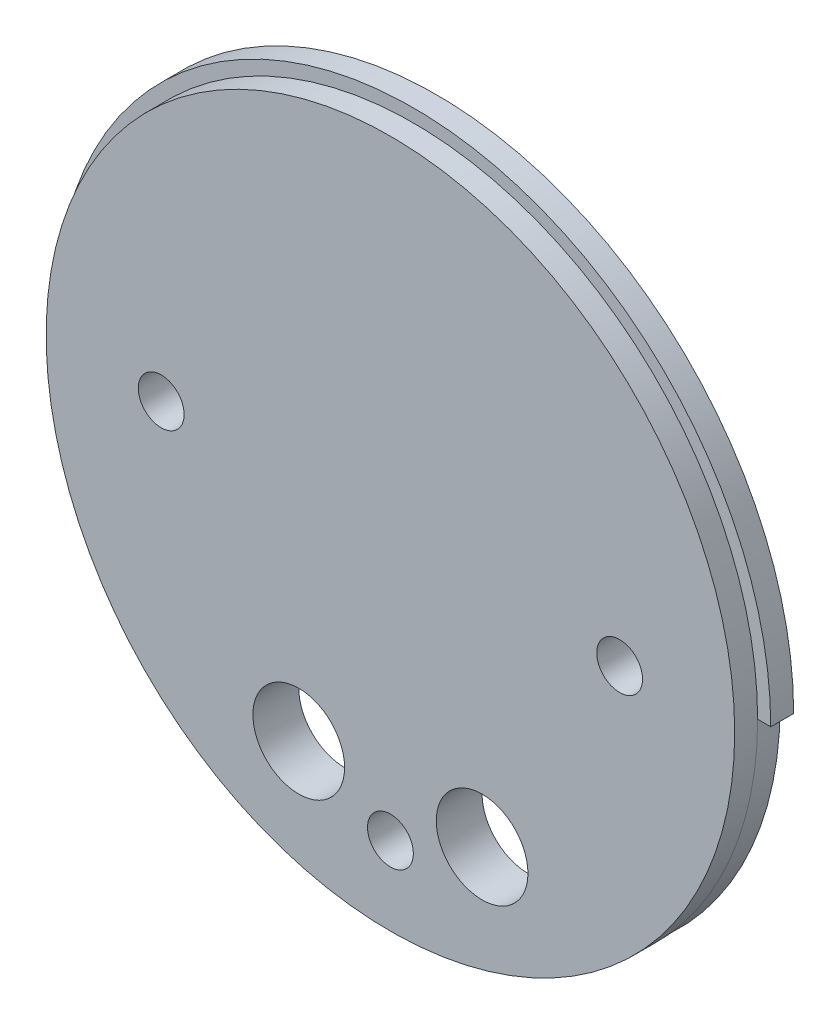
ISO-10303-21;
HEADER;
FILE_DESCRIPTION(('STEP AP214'),'2;1');
FILE_NAME('part.step','',(''),(''),'','','');
FILE_SCHEMA(('AUTOMOTIVE_DESIGN { 1 0 10303 214 1 1 1 1 }'));
ENDSEC;
DATA;
#1=APPLICATION_CONTEXT('core data for automotive mechanical design processes');
#2=APPLICATION_PROTOCOL_DEFINITION('international standard','automotive_design',2000,#1);
#3=PRODUCT_CONTEXT('',#1,'mechanical');
#4=PRODUCT('Part','Part','',(#3));
#5=PRODUCT_RELATED_PRODUCT_CATEGORY('part','',(#4));
#6=PRODUCT_DEFINITION_FORMATION('','',#4);
#7=PRODUCT_DEFINITION_CONTEXT('part definition',#1,'design');
#8=PRODUCT_DEFINITION('design','',#6,#7);
#9=PRODUCT_DEFINITION_SHAPE('','',#8);
#10=(LENGTH_UNIT() NAMED_UNIT(*) SI_UNIT(.MILLI.,.METRE.));
#11=(NAMED_UNIT(*) PLANE_ANGLE_UNIT() SI_UNIT($,.RADIAN.));
#12=(NAMED_UNIT(*) SI_UNIT($,.STERADIAN.) SOLID_ANGLE_UNIT());
#13=UNCERTAINTY_MEASURE_WITH_UNIT(LENGTH_MEASURE(1.E-05),#10,'distance_accuracy_value','');
#14=(GEOMETRIC_REPRESENTATION_CONTEXT(3) GLOBAL_UNCERTAINTY_ASSIGNED_CONTEXT((#13)) GLOBAL_UNIT_ASSIGNED_CONTEXT((#10,
#11,#12)) REPRESENTATION_CONTEXT('',''));
#15=CARTESIAN_POINT('',(0.,0.,0.));
#16=DIRECTION('',(0.,0.,1.));
#17=DIRECTION('',(1.,0.,0.));
#18=AXIS2_PLACEMENT_3D('',#15,#16,#17);
#19=CARTESIAN_POINT('',(0.,0.,3.175));
#20=DIRECTION('',(0.,0.,-1.));
#21=DIRECTION('',(-1.,0.,0.));
#22=AXIS2_PLACEMENT_3D('',#19,#20,#21);
#23=CYLINDRICAL_SURFACE('',#22,49.5046);
#24=CARTESIAN_POINT('',(0.,0.,3.175));
#25=DIRECTION('',(0.,0.,1.));
#26=DIRECTION('',(1.,0.,0.));
#27=AXIS2_PLACEMENT_3D('',#24,#25,#26);
#28=CIRCLE('',#27,49.5046);
#29=CARTESIAN_POINT('',(49.5046,0.,3.175));
#30=VERTEX_POINT('',#29);
#31=CARTESIAN_POINT('',(-49.5046,0.,3.175));
#32=VERTEX_POINT('',#31);
#33=EDGE_CURVE('E149',#30,#32,#28,.T.);
#34=ORIENTED_EDGE('',*,*,#33,.F.);
#35=DIRECTION('',(0.,0.,-1.));
#36=VECTOR('',#35,1.);
#37=CARTESIAN_POINT('',(49.5046,0.,3.175));
#38=LINE('',#37,#36);
#39=CARTESIAN_POINT('',(49.5046,0.,0.));
#40=VERTEX_POINT('',#39);
#41=EDGE_CURVE('E110',#30,#40,#38,.T.);
#42=ORIENTED_EDGE('',*,*,#41,.T.);
#43=CARTESIAN_POINT('',(0.,0.,0.));
#44=DIRECTION('',(0.,0.,1.));
#45=DIRECTION('',(1.,0.,0.));
#46=AXIS2_PLACEMENT_3D('',#43,#44,#45);
#47=CIRCLE('',#46,49.5046);
#48=CARTESIAN_POINT('',(-49.5046,0.,0.));
#49=VERTEX_POINT('',#48);
#50=EDGE_CURVE('E145',#40,#49,#47,.T.);
#51=ORIENTED_EDGE('',*,*,#50,.T.);
#52=DIRECTION('',(0.,0.,-1.));
#53=VECTOR('',#52,1.);
#54=CARTESIAN_POINT('',(-49.5046,0.,3.175));
#55=LINE('',#54,#53);
#56=EDGE_CURVE('E94',#49,#32,#55,.F.);
#57=ORIENTED_EDGE('',*,*,#56,.T.);
#58=EDGE_LOOP('',(#34,#42,#51,#57));
#59=FACE_BOUND('',#58,.T.);
#60=ADVANCED_FACE('F34',(#59),#23,.T.);
#61=CARTESIAN_POINT('',(0.,0.,3.175));
#62=DIRECTION('',(0.,0.,1.));
#63=DIRECTION('',(1.,0.,0.));
#64=AXIS2_PLACEMENT_3D('',#61,#62,#63);
#65=PLANE('',#64);
#66=DIRECTION('',(-1.,0.,0.));
#67=VECTOR('',#66,1.);
#68=CARTESIAN_POINT('',(47.625,0.,3.175));
#69=LINE('',#68,#67);
#70=CARTESIAN_POINT('',(47.6885,0.,3.175));
#71=VERTEX_POINT('',#70);
#72=EDGE_CURVE('E48',#30,#71,#69,.T.);
#73=ORIENTED_EDGE('',*,*,#72,.F.);
#74=ORIENTED_EDGE('',*,*,#33,.T.);
#75=DIRECTION('',(-1.,0.,0.));
#76=VECTOR('',#75,1.);
#77=CARTESIAN_POINT('',(-50.165,0.,3.175));
#78=LINE('',#77,#76);
#79=CARTESIAN_POINT('',(-47.6885,0.,3.175));
#80=VERTEX_POINT('',#79);
#81=EDGE_CURVE('E105',#80,#32,#78,.T.);
#82=ORIENTED_EDGE('',*,*,#81,.F.);
#83=CARTESIAN_POINT('',(0.,0.,3.175));
#84=DIRECTION('',(0.,0.,1.));
#85=DIRECTION('',(1.,0.,0.));
#86=AXIS2_PLACEMENT_3D('',#83,#84,#85);
#87=CIRCLE('',#86,47.6885);
#88=EDGE_CURVE('E41',#71,#80,#87,.T.);
#89=ORIENTED_EDGE('',*,*,#88,.F.);
#90=EDGE_LOOP('',(#73,#74,#82,#89));
#91=FACE_BOUND('',#90,.T.);
#92=ADVANCED_FACE('F156',(#91),#65,.T.);
#93=CARTESIAN_POINT('',(0.,0.,0.));
#94=DIRECTION('',(0.,0.,1.));
#95=DIRECTION('',(1.,0.,0.));
#96=AXIS2_PLACEMENT_3D('',#93,#94,#95);
#97=PLANE('',#96);
#98=CARTESIAN_POINT('',(-31.75,0.,0.));
#99=DIRECTION('',(0.,0.,1.));
#100=DIRECTION('',(1.,0.,0.));
#101=AXIS2_PLACEMENT_3D('',#98,#99,#100);
#102=CIRCLE('',#101,3.17500000000001);
#103=CARTESIAN_POINT('',(-28.575,0.,0.));
#104=VERTEX_POINT('',#103);
#105=EDGE_CURVE('E113',#104,#104,#102,.T.);
#106=ORIENTED_EDGE('',*,*,#105,.T.);
#107=EDGE_LOOP('',(#106));
#108=FACE_BOUND('',#107,.T.);
#109=CARTESIAN_POINT('',(0.,-36.8046,0.));
#110=DIRECTION('',(0.,0.,1.));
#111=DIRECTION('',(1.,0.,0.));
#112=AXIS2_PLACEMENT_3D('',#109,#110,#111);
#113=CIRCLE('',#112,3.175);
#114=CARTESIAN_POINT('',(3.175,-36.8046,0.));
#115=VERTEX_POINT('',#114);
#116=EDGE_CURVE('E128',#115,#115,#113,.T.);
#117=ORIENTED_EDGE('',*,*,#116,.T.);
#118=EDGE_LOOP('',(#117));
#119=FACE_BOUND('',#118,.T.);
#120=CARTESIAN_POINT('',(12.7,-31.2353524431853,0.));
#121=DIRECTION('',(0.,0.,1.));
#122=DIRECTION('',(1.,0.,0.));
#123=AXIS2_PLACEMENT_3D('',#120,#121,#122);
#124=CIRCLE('',#123,6.35);
#125=CARTESIAN_POINT('',(19.05,-31.2353524431853,0.));
#126=VERTEX_POINT('',#125);
#127=EDGE_CURVE('E121',#126,#126,#124,.T.);
#128=ORIENTED_EDGE('',*,*,#127,.T.);
#129=EDGE_LOOP('',(#128));
#130=FACE_BOUND('',#129,.T.);
#131=CARTESIAN_POINT('',(-12.7,-31.2353524431853,0.));
#132=DIRECTION('',(0.,0.,1.));
#133=DIRECTION('',(1.,0.,0.));
#134=AXIS2_PLACEMENT_3D('',#131,#132,#133);
#135=CIRCLE('',#134,6.35);
#136=CARTESIAN_POINT('',(-6.35,-31.2353524431853,0.));
#137=VERTEX_POINT('',#136);
#138=EDGE_CURVE('E138',#137,#137,#135,.T.);
#139=ORIENTED_EDGE('',*,*,#138,.T.);
#140=EDGE_LOOP('',(#139));
#141=FACE_BOUND('',#140,.T.);
#142=CARTESIAN_POINT('',(31.75,0.,0.));
#143=DIRECTION('',(0.,0.,1.));
#144=DIRECTION('',(1.,0.,0.));
#145=AXIS2_PLACEMENT_3D('',#142,#143,#144);
#146=CIRCLE('',#145,3.17500000000001);
#147=CARTESIAN_POINT('',(34.925,0.,0.));
#148=VERTEX_POINT('',#147);
#149=EDGE_CURVE('E120',#148,#148,#146,.T.);
#150=ORIENTED_EDGE('',*,*,#149,.T.);
#151=EDGE_LOOP('',(#150));
#152=FACE_BOUND('',#151,.T.);
#153=ORIENTED_EDGE('',*,*,#50,.F.);
#154=DIRECTION('',(-1.,0.,0.));
#155=VECTOR('',#154,1.);
#156=CARTESIAN_POINT('',(0.,0.,0.));
#157=LINE('',#156,#155);
#158=CARTESIAN_POINT('',(47.625,0.,0.));
#159=VERTEX_POINT('',#158);
#160=EDGE_CURVE('E11',#40,#159,#157,.T.);
#161=ORIENTED_EDGE('',*,*,#160,.T.);
#162=CARTESIAN_POINT('',(0.,0.,0.));
#163=DIRECTION('',(0.,0.,-1.));
#164=DIRECTION('',(1.,0.,0.));
#165=AXIS2_PLACEMENT_3D('',#162,#163,#164);
#166=CIRCLE('',#165,47.625);
#167=CARTESIAN_POINT('',(-47.625,0.,0.));
#168=VERTEX_POINT('',#167);
#169=EDGE_CURVE('E82',#159,#168,#166,.T.);
#170=ORIENTED_EDGE('',*,*,#169,.T.);
#171=DIRECTION('',(-1.,0.,0.));
#172=VECTOR('',#171,1.);
#173=CARTESIAN_POINT('',(-50.165,0.,0.));
#174=LINE('',#173,#172);
#175=EDGE_CURVE('E89',#168,#49,#174,.T.);
#176=ORIENTED_EDGE('',*,*,#175,.T.);
#177=EDGE_LOOP('',(#153,#161,#170,#176));
#178=FACE_BOUND('',#177,.T.);
#179=ADVANCED_FACE('F99',(#108,#119,#130,#141,#152,#178),#97,.F.);
#180=CARTESIAN_POINT('',(0.,0.,6.35));
#181=DIRECTION('',(0.,0.,-1.));
#182=DIRECTION('',(-1.,0.,0.));
#183=AXIS2_PLACEMENT_3D('',#180,#181,#182);
#184=CYLINDRICAL_SURFACE('',#183,47.6885);
#185=CARTESIAN_POINT('',(0.,0.,6.35));
#186=DIRECTION('',(0.,0.,1.));
#187=DIRECTION('',(1.,0.,0.));
#188=AXIS2_PLACEMENT_3D('',#185,#186,#187);
#189=CIRCLE('',#188,47.6885);
#190=CARTESIAN_POINT('',(47.6885,0.,6.35));
#191=VERTEX_POINT('',#190);
#192=EDGE_CURVE('E116',#191,#191,#189,.T.);
#193=ORIENTED_EDGE('',*,*,#192,.F.);
#194=EDGE_LOOP('',(#193));
#195=FACE_BOUND('',#194,.T.);
#196=ORIENTED_EDGE('',*,*,#88,.T.);
#197=EDGE_CURVE('E148',#80,#71,#87,.T.);
#198=ORIENTED_EDGE('',*,*,#197,.T.);
#199=EDGE_LOOP('',(#196,#198));
#200=FACE_BOUND('',#199,.T.);
#201=ADVANCED_FACE('F160',(#195,#200),#184,.T.);
#202=CARTESIAN_POINT('',(0.,0.,6.35));
#203=DIRECTION('',(0.,0.,1.));
#204=DIRECTION('',(1.,0.,0.));
#205=AXIS2_PLACEMENT_3D('',#202,#203,#204);
#206=PLANE('',#205);
#207=CARTESIAN_POINT('',(-31.75,0.,6.35));
#208=DIRECTION('',(0.,0.,1.));
#209=DIRECTION('',(1.,0.,0.));
#210=AXIS2_PLACEMENT_3D('',#207,#208,#209);
#211=CIRCLE('',#210,3.17500000000001);
#212=CARTESIAN_POINT('',(-28.575,0.,6.35));
#213=VERTEX_POINT('',#212);
#214=EDGE_CURVE('E117',#213,#213,#211,.T.);
#215=ORIENTED_EDGE('',*,*,#214,.F.);
#216=EDGE_LOOP('',(#215));
#217=FACE_BOUND('',#216,.T.);
#218=CARTESIAN_POINT('',(0.,-36.8046,6.35));
#219=DIRECTION('',(0.,0.,1.));
#220=DIRECTION('',(1.,0.,0.));
#221=AXIS2_PLACEMENT_3D('',#218,#219,#220);
#222=CIRCLE('',#221,3.175);
#223=CARTESIAN_POINT('',(3.175,-36.8046,6.35));
#224=VERTEX_POINT('',#223);
#225=EDGE_CURVE('E112',#224,#224,#222,.T.);
#226=ORIENTED_EDGE('',*,*,#225,.F.);
#227=EDGE_LOOP('',(#226));
#228=FACE_BOUND('',#227,.T.);
#229=CARTESIAN_POINT('',(12.7,-31.2353524431853,6.35));
#230=DIRECTION('',(0.,0.,1.));
#231=DIRECTION('',(1.,0.,0.));
#232=AXIS2_PLACEMENT_3D('',#229,#230,#231);
#233=CIRCLE('',#232,6.35);
#234=CARTESIAN_POINT('',(19.05,-31.2353524431853,6.35));
#235=VERTEX_POINT('',#234);
#236=EDGE_CURVE('E125',#235,#235,#233,.T.);
#237=ORIENTED_EDGE('',*,*,#236,.F.);
#238=EDGE_LOOP('',(#237));
#239=FACE_BOUND('',#238,.T.);
#240=CARTESIAN_POINT('',(-12.7,-31.2353524431853,6.35));
#241=DIRECTION('',(0.,0.,1.));
#242=DIRECTION('',(1.,0.,0.));
#243=AXIS2_PLACEMENT_3D('',#240,#241,#242);
#244=CIRCLE('',#243,6.35);
#245=CARTESIAN_POINT('',(-6.35,-31.2353524431853,6.35));
#246=VERTEX_POINT('',#245);
#247=EDGE_CURVE('E124',#246,#246,#244,.T.);
#248=ORIENTED_EDGE('',*,*,#247,.F.);
#249=EDGE_LOOP('',(#248));
#250=FACE_BOUND('',#249,.T.);
#251=CARTESIAN_POINT('',(31.75,0.,6.35));
#252=DIRECTION('',(0.,0.,1.));
#253=DIRECTION('',(1.,0.,0.));
#254=AXIS2_PLACEMENT_3D('',#251,#252,#253);
#255=CIRCLE('',#254,3.17500000000001);
#256=CARTESIAN_POINT('',(34.925,0.,6.35));
#257=VERTEX_POINT('',#256);
#258=EDGE_CURVE('E135',#257,#257,#255,.T.);
#259=ORIENTED_EDGE('',*,*,#258,.F.);
#260=EDGE_LOOP('',(#259));
#261=FACE_BOUND('',#260,.T.);
#262=ORIENTED_EDGE('',*,*,#192,.T.);
#263=EDGE_LOOP('',(#262));
#264=FACE_BOUND('',#263,.T.);
#265=ADVANCED_FACE('F184',(#217,#228,#239,#250,#261,#264),#206,.T.);
#266=CARTESIAN_POINT('',(31.75,0.,0.));
#267=DIRECTION('',(0.,0.,1.));
#268=DIRECTION('',(1.,0.,0.));
#269=AXIS2_PLACEMENT_3D('',#266,#267,#268);
#270=CYLINDRICAL_SURFACE('',#269,3.17500000000001);
#271=ORIENTED_EDGE('',*,*,#149,.F.);
#272=EDGE_LOOP('',(#271));
#273=FACE_BOUND('',#272,.T.);
#274=ORIENTED_EDGE('',*,*,#258,.T.);
#275=EDGE_LOOP('',(#274));
#276=FACE_BOUND('',#275,.T.);
#277=ADVANCED_FACE('F188',(#273,#276),#270,.F.);
#278=CARTESIAN_POINT('',(-12.7,-31.2353524431853,0.));
#279=DIRECTION('',(0.,0.,1.));
#280=DIRECTION('',(1.,0.,0.));
#281=AXIS2_PLACEMENT_3D('',#278,#279,#280);
#282=CYLINDRICAL_SURFACE('',#281,6.35);
#283=ORIENTED_EDGE('',*,*,#138,.F.);
#284=EDGE_LOOP('',(#283));
#285=FACE_BOUND('',#284,.T.);
#286=ORIENTED_EDGE('',*,*,#247,.T.);
#287=EDGE_LOOP('',(#286));
#288=FACE_BOUND('',#287,.T.);
#289=ADVANCED_FACE('F190',(#285,#288),#282,.F.);
#290=CARTESIAN_POINT('',(12.7,-31.2353524431853,0.));
#291=DIRECTION('',(0.,0.,1.));
#292=DIRECTION('',(1.,0.,0.));
#293=AXIS2_PLACEMENT_3D('',#290,#291,#292);
#294=CYLINDRICAL_SURFACE('',#293,6.35);
#295=ORIENTED_EDGE('',*,*,#127,.F.);
#296=EDGE_LOOP('',(#295));
#297=FACE_BOUND('',#296,.T.);
#298=ORIENTED_EDGE('',*,*,#236,.T.);
#299=EDGE_LOOP('',(#298));
#300=FACE_BOUND('',#299,.T.);
#301=ADVANCED_FACE('F193',(#297,#300),#294,.F.);
#302=CARTESIAN_POINT('',(0.,-36.8046,0.));
#303=DIRECTION('',(0.,0.,1.));
#304=DIRECTION('',(1.,0.,0.));
#305=AXIS2_PLACEMENT_3D('',#302,#303,#304);
#306=CYLINDRICAL_SURFACE('',#305,3.175);
#307=ORIENTED_EDGE('',*,*,#116,.F.);
#308=EDGE_LOOP('',(#307));
#309=FACE_BOUND('',#308,.T.);
#310=ORIENTED_EDGE('',*,*,#225,.T.);
#311=EDGE_LOOP('',(#310));
#312=FACE_BOUND('',#311,.T.);
#313=ADVANCED_FACE('F198',(#309,#312),#306,.F.);
#314=CARTESIAN_POINT('',(-31.75,0.,0.));
#315=DIRECTION('',(0.,0.,1.));
#316=DIRECTION('',(1.,0.,0.));
#317=AXIS2_PLACEMENT_3D('',#314,#315,#316);
#318=CYLINDRICAL_SURFACE('',#317,3.17500000000001);
#319=ORIENTED_EDGE('',*,*,#105,.F.);
#320=EDGE_LOOP('',(#319));
#321=FACE_BOUND('',#320,.T.);
#322=ORIENTED_EDGE('',*,*,#214,.T.);
#323=EDGE_LOOP('',(#322));
#324=FACE_BOUND('',#323,.T.);
#325=ADVANCED_FACE('F201',(#321,#324),#318,.F.);
#326=CARTESIAN_POINT('',(47.625,0.,0.));
#327=DIRECTION('',(0.,1.,0.));
#328=DIRECTION('',(0.,0.,1.));
#329=AXIS2_PLACEMENT_3D('',#326,#327,#328);
#330=PLANE('',#329);
#331=ORIENTED_EDGE('',*,*,#72,.T.);
#332=CARTESIAN_POINT('',(47.625,0.,3.175));
#333=VERTEX_POINT('',#332);
#334=EDGE_CURVE('E101',#71,#333,#69,.T.);
#335=ORIENTED_EDGE('',*,*,#334,.T.);
#336=DIRECTION('',(0.,0.,1.));
#337=VECTOR('',#336,1.);
#338=CARTESIAN_POINT('',(47.625,0.,0.));
#339=LINE('',#338,#337);
#340=EDGE_CURVE('E88',#159,#333,#339,.T.);
#341=ORIENTED_EDGE('',*,*,#340,.F.);
#342=ORIENTED_EDGE('',*,*,#160,.F.);
#343=ORIENTED_EDGE('',*,*,#41,.F.);
#344=EDGE_LOOP('',(#331,#335,#341,#342,#343));
#345=FACE_BOUND('',#344,.T.);
#346=ADVANCED_FACE('F153',(#345),#330,.F.);
#347=CARTESIAN_POINT('',(-50.165,0.,0.));
#348=DIRECTION('',(0.,1.,0.));
#349=DIRECTION('',(0.,0.,1.));
#350=AXIS2_PLACEMENT_3D('',#347,#348,#349);
#351=PLANE('',#350);
#352=ORIENTED_EDGE('',*,*,#175,.F.);
#353=DIRECTION('',(0.,0.,1.));
#354=VECTOR('',#353,1.);
#355=CARTESIAN_POINT('',(-47.625,0.,0.));
#356=LINE('',#355,#354);
#357=CARTESIAN_POINT('',(-47.625,0.,3.175));
#358=VERTEX_POINT('',#357);
#359=EDGE_CURVE('E77',#168,#358,#356,.T.);
#360=ORIENTED_EDGE('',*,*,#359,.T.);
#361=EDGE_CURVE('E106',#358,#80,#78,.T.);
#362=ORIENTED_EDGE('',*,*,#361,.T.);
#363=ORIENTED_EDGE('',*,*,#81,.T.);
#364=ORIENTED_EDGE('',*,*,#56,.F.);
#365=EDGE_LOOP('',(#352,#360,#362,#363,#364));
#366=FACE_BOUND('',#365,.T.);
#367=ADVANCED_FACE('F92',(#366),#351,.F.);
#368=CARTESIAN_POINT('',(0.,0.,3.175));
#369=DIRECTION('',(0.,0.,1.));
#370=DIRECTION('',(1.,0.,0.));
#371=AXIS2_PLACEMENT_3D('',#368,#369,#370);
#372=PLANE('',#371);
#373=ORIENTED_EDGE('',*,*,#361,.F.);
#374=CARTESIAN_POINT('',(0.,0.,3.175));
#375=DIRECTION('',(0.,0.,-1.));
#376=DIRECTION('',(1.,0.,0.));
#377=AXIS2_PLACEMENT_3D('',#374,#375,#376);
#378=CIRCLE('',#377,47.625);
#379=EDGE_CURVE('E84',#333,#358,#378,.T.);
#380=ORIENTED_EDGE('',*,*,#379,.F.);
#381=ORIENTED_EDGE('',*,*,#334,.F.);
#382=ORIENTED_EDGE('',*,*,#197,.F.);
#383=EDGE_LOOP('',(#373,#380,#381,#382));
#384=FACE_BOUND('',#383,.T.);
#385=ADVANCED_FACE('F162',(#384),#372,.F.);
#386=CARTESIAN_POINT('',(0.,0.,0.));
#387=DIRECTION('',(0.,0.,1.));
#388=DIRECTION('',(1.,0.,0.));
#389=AXIS2_PLACEMENT_3D('',#386,#387,#388);
#390=CYLINDRICAL_SURFACE('',#389,47.625);
#391=ORIENTED_EDGE('',*,*,#379,.T.);
#392=ORIENTED_EDGE('',*,*,#359,.F.);
#393=ORIENTED_EDGE('',*,*,#169,.F.);
#394=ORIENTED_EDGE('',*,*,#340,.T.);
#395=EDGE_LOOP('',(#391,#392,#393,#394));
#396=FACE_BOUND('',#395,.T.);
#397=ADVANCED_FACE('F79',(#396),#390,.T.);
#398=CLOSED_SHELL('',(#60,#92,#179,#201,#265,#277,#289,#301,#313,#325,#346,#367,#385,#397));
#399=MANIFOLD_SOLID_BREP('B2',#398);
#400=ADVANCED_BREP_SHAPE_REPRESENTATION('',(#18,#399),#14);
#401=SHAPE_DEFINITION_REPRESENTATION(#9,#400);
ENDSEC;
END-ISO-10303-21;
